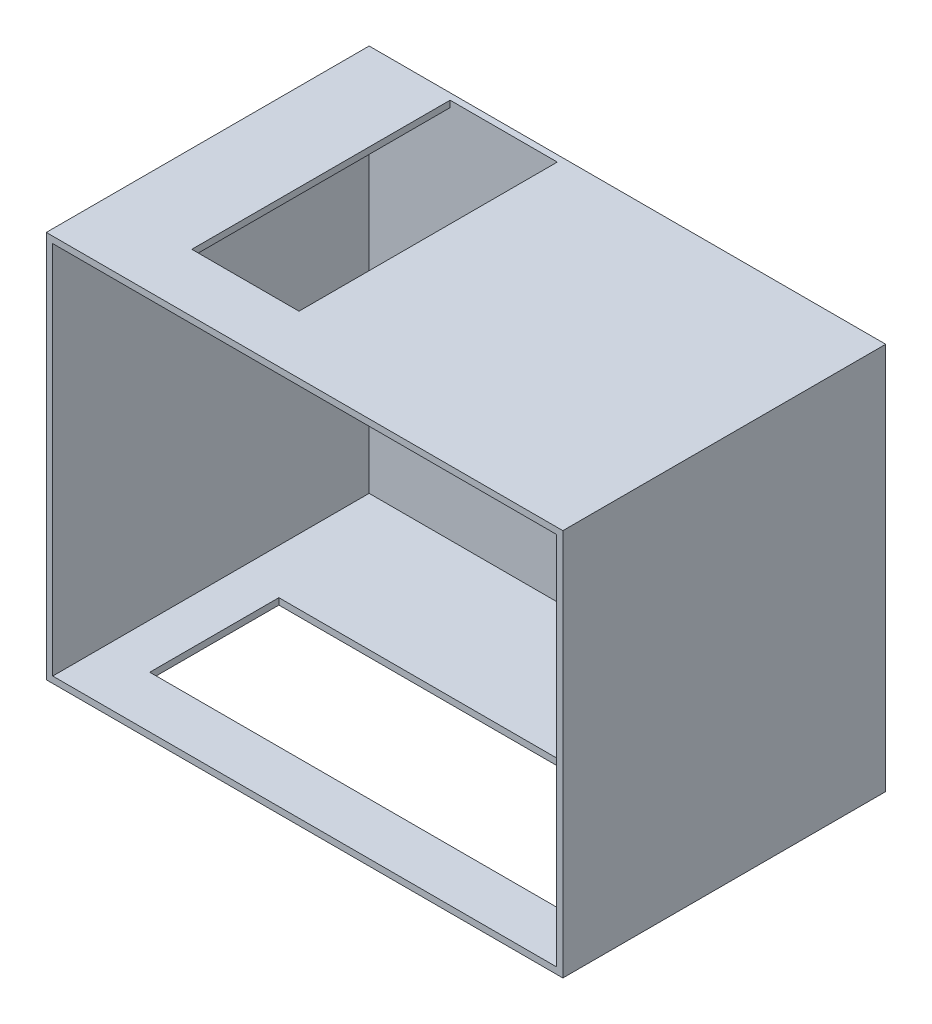
ISO-10303-21;
HEADER;
FILE_DESCRIPTION(('STEP AP214'),'2;1');
FILE_NAME('part.step','',(''),(''),'','','');
FILE_SCHEMA(('AUTOMOTIVE_DESIGN { 1 0 10303 214 1 1 1 1 }'));
ENDSEC;
DATA;
#1=APPLICATION_CONTEXT('core data for automotive mechanical design processes');
#2=APPLICATION_PROTOCOL_DEFINITION('international standard','automotive_design',2000,#1);
#3=PRODUCT_CONTEXT('',#1,'mechanical');
#4=PRODUCT('Part','Part','',(#3));
#5=PRODUCT_RELATED_PRODUCT_CATEGORY('part','',(#4));
#6=PRODUCT_DEFINITION_FORMATION('','',#4);
#7=PRODUCT_DEFINITION_CONTEXT('part definition',#1,'design');
#8=PRODUCT_DEFINITION('design','',#6,#7);
#9=PRODUCT_DEFINITION_SHAPE('','',#8);
#10=(LENGTH_UNIT() NAMED_UNIT(*) SI_UNIT(.MILLI.,.METRE.));
#11=(NAMED_UNIT(*) PLANE_ANGLE_UNIT() SI_UNIT($,.RADIAN.));
#12=(NAMED_UNIT(*) SI_UNIT($,.STERADIAN.) SOLID_ANGLE_UNIT());
#13=UNCERTAINTY_MEASURE_WITH_UNIT(LENGTH_MEASURE(1.E-05),#10,'distance_accuracy_value','');
#14=(GEOMETRIC_REPRESENTATION_CONTEXT(3) GLOBAL_UNCERTAINTY_ASSIGNED_CONTEXT((#13)) GLOBAL_UNIT_ASSIGNED_CONTEXT((#10,
#11,#12)) REPRESENTATION_CONTEXT('',''));
#15=CARTESIAN_POINT('',(0.,0.,0.));
#16=DIRECTION('',(0.,0.,1.));
#17=DIRECTION('',(1.,0.,0.));
#18=AXIS2_PLACEMENT_3D('',#15,#16,#17);
#19=CARTESIAN_POINT('',(-51.8945911096033,2956.56230521937,2500.));
#20=DIRECTION('',(1.,0.,0.));
#21=DIRECTION('',(0.,1.,0.));
#22=AXIS2_PLACEMENT_3D('',#19,#20,#21);
#23=PLANE('',#22);
#24=DIRECTION('',(0.,-1.,0.));
#25=VECTOR('',#24,1.);
#26=CARTESIAN_POINT('',(-51.8945911096033,2956.56230521937,0.));
#27=LINE('',#26,#25);
#28=CARTESIAN_POINT('',(-51.8945911096033,2956.56230521937,0.));
#29=VERTEX_POINT('',#28);
#30=CARTESIAN_POINT('',(-51.894591109603,-43.4376947806306,0.));
#31=VERTEX_POINT('',#30);
#32=EDGE_CURVE('E216',#29,#31,#27,.T.);
#33=ORIENTED_EDGE('',*,*,#32,.T.);
#34=DIRECTION('',(0.,0.,-1.));
#35=VECTOR('',#34,1.);
#36=CARTESIAN_POINT('',(-51.894591109603,-43.4376947806306,2500.));
#37=LINE('',#36,#35);
#38=CARTESIAN_POINT('',(-51.894591109603,-43.4376947806306,2500.));
#39=VERTEX_POINT('',#38);
#40=EDGE_CURVE('E11',#39,#31,#37,.T.);
#41=ORIENTED_EDGE('',*,*,#40,.F.);
#42=DIRECTION('',(0.,-1.,0.));
#43=VECTOR('',#42,1.);
#44=CARTESIAN_POINT('',(-51.8945911096033,2956.56230521937,2500.));
#45=LINE('',#44,#43);
#46=CARTESIAN_POINT('',(-51.8945911096033,2956.56230521937,2500.));
#47=VERTEX_POINT('',#46);
#48=EDGE_CURVE('E241',#47,#39,#45,.T.);
#49=ORIENTED_EDGE('',*,*,#48,.F.);
#50=DIRECTION('',(0.,0.,-1.));
#51=VECTOR('',#50,1.);
#52=CARTESIAN_POINT('',(-51.8945911096033,2956.56230521937,2500.));
#53=LINE('',#52,#51);
#54=EDGE_CURVE('E251',#47,#29,#53,.T.);
#55=ORIENTED_EDGE('',*,*,#54,.T.);
#56=EDGE_LOOP('',(#33,#41,#49,#55));
#57=FACE_BOUND('',#56,.T.);
#58=ADVANCED_FACE('F31',(#57),#23,.F.);
#59=CARTESIAN_POINT('',(-51.894591109603,-43.4376947806306,2500.));
#60=DIRECTION('',(0.,1.,0.));
#61=DIRECTION('',(0.,0.,1.));
#62=AXIS2_PLACEMENT_3D('',#59,#60,#61);
#63=PLANE('',#62);
#64=DIRECTION('',(1.,0.,0.));
#65=VECTOR('',#64,1.);
#66=CARTESIAN_POINT('',(348.105408890397,-43.4376947806306,1098.95032881053));
#67=LINE('',#66,#65);
#68=CARTESIAN_POINT('',(348.105408890397,-43.4376947806306,1098.95032881053));
#69=VERTEX_POINT('',#68);
#70=CARTESIAN_POINT('',(3548.1054088904,-43.4376947806306,1098.95032881053));
#71=VERTEX_POINT('',#70);
#72=EDGE_CURVE('E191',#69,#71,#67,.T.);
#73=ORIENTED_EDGE('',*,*,#72,.F.);
#74=DIRECTION('',(0.,0.,-1.));
#75=VECTOR('',#74,1.);
#76=CARTESIAN_POINT('',(348.105408890397,-43.4376947806306,2098.95032881053));
#77=LINE('',#76,#75);
#78=CARTESIAN_POINT('',(348.105408890397,-43.4376947806306,2098.95032881053));
#79=VERTEX_POINT('',#78);
#80=EDGE_CURVE('E194',#79,#69,#77,.T.);
#81=ORIENTED_EDGE('',*,*,#80,.F.);
#82=DIRECTION('',(-1.,0.,0.));
#83=VECTOR('',#82,1.);
#84=CARTESIAN_POINT('',(348.105408890397,-43.4376947806306,2098.95032881053));
#85=LINE('',#84,#83);
#86=CARTESIAN_POINT('',(3548.1054088904,-43.4376947806306,2098.95032881053));
#87=VERTEX_POINT('',#86);
#88=EDGE_CURVE('E184',#87,#79,#85,.T.);
#89=ORIENTED_EDGE('',*,*,#88,.F.);
#90=DIRECTION('',(0.,0.,1.));
#91=VECTOR('',#90,1.);
#92=CARTESIAN_POINT('',(3548.1054088904,-43.4376947806306,2098.95032881053));
#93=LINE('',#92,#91);
#94=EDGE_CURVE('E188',#71,#87,#93,.T.);
#95=ORIENTED_EDGE('',*,*,#94,.F.);
#96=EDGE_LOOP('',(#73,#81,#89,#95));
#97=FACE_BOUND('',#96,.T.);
#98=DIRECTION('',(1.,0.,0.));
#99=VECTOR('',#98,1.);
#100=CARTESIAN_POINT('',(-51.894591109603,-43.4376947806306,0.));
#101=LINE('',#100,#99);
#102=CARTESIAN_POINT('',(3948.1054088904,-43.4376947806306,0.));
#103=VERTEX_POINT('',#102);
#104=EDGE_CURVE('E254',#31,#103,#101,.T.);
#105=ORIENTED_EDGE('',*,*,#104,.T.);
#106=DIRECTION('',(0.,0.,-1.));
#107=VECTOR('',#106,1.);
#108=CARTESIAN_POINT('',(3948.1054088904,-43.4376947806306,2500.));
#109=LINE('',#108,#107);
#110=CARTESIAN_POINT('',(3948.1054088904,-43.4376947806306,2500.));
#111=VERTEX_POINT('',#110);
#112=EDGE_CURVE('E38',#111,#103,#109,.T.);
#113=ORIENTED_EDGE('',*,*,#112,.F.);
#114=DIRECTION('',(1.,0.,0.));
#115=VECTOR('',#114,1.);
#116=CARTESIAN_POINT('',(-51.894591109603,-43.4376947806306,2500.));
#117=LINE('',#116,#115);
#118=EDGE_CURVE('E244',#39,#111,#117,.T.);
#119=ORIENTED_EDGE('',*,*,#118,.F.);
#120=ORIENTED_EDGE('',*,*,#40,.T.);
#121=EDGE_LOOP('',(#105,#113,#119,#120));
#122=FACE_BOUND('',#121,.T.);
#123=ADVANCED_FACE('F282',(#97,#122),#63,.F.);
#124=CARTESIAN_POINT('',(3948.1054088904,2956.56230521937,2500.));
#125=DIRECTION('',(-1.,0.,0.));
#126=DIRECTION('',(0.,-1.,0.));
#127=AXIS2_PLACEMENT_3D('',#124,#125,#126);
#128=PLANE('',#127);
#129=DIRECTION('',(0.,1.,0.));
#130=VECTOR('',#129,1.);
#131=CARTESIAN_POINT('',(3948.1054088904,2956.56230521937,0.));
#132=LINE('',#131,#130);
#133=CARTESIAN_POINT('',(3948.1054088904,2956.56230521937,0.));
#134=VERTEX_POINT('',#133);
#135=EDGE_CURVE('E256',#103,#134,#132,.T.);
#136=ORIENTED_EDGE('',*,*,#135,.T.);
#137=DIRECTION('',(0.,0.,-1.));
#138=VECTOR('',#137,1.);
#139=CARTESIAN_POINT('',(3948.1054088904,2956.56230521937,2500.));
#140=LINE('',#139,#138);
#141=CARTESIAN_POINT('',(3948.1054088904,2956.56230521937,2500.));
#142=VERTEX_POINT('',#141);
#143=EDGE_CURVE('E261',#142,#134,#140,.T.);
#144=ORIENTED_EDGE('',*,*,#143,.F.);
#145=DIRECTION('',(0.,1.,0.));
#146=VECTOR('',#145,1.);
#147=CARTESIAN_POINT('',(3948.1054088904,2956.56230521937,2500.));
#148=LINE('',#147,#146);
#149=EDGE_CURVE('E247',#111,#142,#148,.T.);
#150=ORIENTED_EDGE('',*,*,#149,.F.);
#151=ORIENTED_EDGE('',*,*,#112,.T.);
#152=EDGE_LOOP('',(#136,#144,#150,#151));
#153=FACE_BOUND('',#152,.T.);
#154=ADVANCED_FACE('F268',(#153),#128,.F.);
#155=CARTESIAN_POINT('',(-51.8945911096033,2956.56230521937,2500.));
#156=DIRECTION('',(0.,-1.,0.));
#157=DIRECTION('',(0.,0.,-1.));
#158=AXIS2_PLACEMENT_3D('',#155,#156,#157);
#159=PLANE('',#158);
#160=DIRECTION('',(1.,0.,0.));
#161=VECTOR('',#160,1.);
#162=CARTESIAN_POINT('',(624.93063748417,2956.56230521937,2050.));
#163=LINE('',#162,#161);
#164=CARTESIAN_POINT('',(624.93063748417,2956.56230521937,2050.));
#165=VERTEX_POINT('',#164);
#166=CARTESIAN_POINT('',(1454.93063748417,2956.56230521937,2050.));
#167=VERTEX_POINT('',#166);
#168=EDGE_CURVE('E164',#165,#167,#163,.T.);
#169=ORIENTED_EDGE('',*,*,#168,.F.);
#170=DIRECTION('',(0.,0.,1.));
#171=VECTOR('',#170,1.);
#172=CARTESIAN_POINT('',(624.930637484169,2956.56230521937,50.));
#173=LINE('',#172,#171);
#174=CARTESIAN_POINT('',(624.930637484169,2956.56230521937,50.));
#175=VERTEX_POINT('',#174);
#176=EDGE_CURVE('E145',#175,#165,#173,.T.);
#177=ORIENTED_EDGE('',*,*,#176,.F.);
#178=DIRECTION('',(-1.,0.,0.));
#179=VECTOR('',#178,1.);
#180=CARTESIAN_POINT('',(624.930637484169,2956.56230521937,50.));
#181=LINE('',#180,#179);
#182=CARTESIAN_POINT('',(1454.93063748417,2956.56230521937,49.9999999999998));
#183=VERTEX_POINT('',#182);
#184=EDGE_CURVE('E153',#183,#175,#181,.T.);
#185=ORIENTED_EDGE('',*,*,#184,.F.);
#186=DIRECTION('',(0.,0.,-1.));
#187=VECTOR('',#186,1.);
#188=CARTESIAN_POINT('',(1454.93063748417,2956.56230521937,50.));
#189=LINE('',#188,#187);
#190=EDGE_CURVE('E45',#167,#183,#189,.T.);
#191=ORIENTED_EDGE('',*,*,#190,.F.);
#192=EDGE_LOOP('',(#169,#177,#185,#191));
#193=FACE_BOUND('',#192,.T.);
#194=DIRECTION('',(-1.,0.,0.));
#195=VECTOR('',#194,1.);
#196=CARTESIAN_POINT('',(-51.8945911096033,2956.56230521937,0.));
#197=LINE('',#196,#195);
#198=EDGE_CURVE('E245',#134,#29,#197,.T.);
#199=ORIENTED_EDGE('',*,*,#198,.T.);
#200=ORIENTED_EDGE('',*,*,#54,.F.);
#201=DIRECTION('',(-1.,0.,0.));
#202=VECTOR('',#201,1.);
#203=CARTESIAN_POINT('',(-51.8945911096033,2956.56230521937,2500.));
#204=LINE('',#203,#202);
#205=EDGE_CURVE('E249',#142,#47,#204,.T.);
#206=ORIENTED_EDGE('',*,*,#205,.F.);
#207=ORIENTED_EDGE('',*,*,#143,.T.);
#208=EDGE_LOOP('',(#199,#200,#206,#207));
#209=FACE_BOUND('',#208,.T.);
#210=ADVANCED_FACE('F161',(#193,#209),#159,.F.);
#211=CARTESIAN_POINT('',(-51.894591109603,-43.4376947806306,2500.));
#212=DIRECTION('',(0.,0.,1.));
#213=DIRECTION('',(1.,0.,0.));
#214=AXIS2_PLACEMENT_3D('',#211,#212,#213);
#215=PLANE('',#214);
#216=DIRECTION('',(0.,-1.,0.));
#217=VECTOR('',#216,1.);
#218=CARTESIAN_POINT('',(-1.89459110960333,2956.56230521937,2500.));
#219=LINE('',#218,#217);
#220=CARTESIAN_POINT('',(-1.89459110960332,2906.56230521937,2500.));
#221=VERTEX_POINT('',#220);
#222=CARTESIAN_POINT('',(-1.89459110960296,6.56230521936936,2500.));
#223=VERTEX_POINT('',#222);
#224=EDGE_CURVE('E233',#221,#223,#219,.T.);
#225=ORIENTED_EDGE('',*,*,#224,.F.);
#226=DIRECTION('',(-1.,0.,0.));
#227=VECTOR('',#226,1.);
#228=CARTESIAN_POINT('',(-51.8945911096033,2906.56230521937,2500.));
#229=LINE('',#228,#227);
#230=CARTESIAN_POINT('',(3898.1054088904,2906.56230521937,2500.));
#231=VERTEX_POINT('',#230);
#232=EDGE_CURVE('E222',#231,#221,#229,.T.);
#233=ORIENTED_EDGE('',*,*,#232,.F.);
#234=DIRECTION('',(0.,1.,0.));
#235=VECTOR('',#234,1.);
#236=CARTESIAN_POINT('',(3898.1054088904,2956.56230521937,2500.));
#237=LINE('',#236,#235);
#238=CARTESIAN_POINT('',(3898.1054088904,6.56230521936936,2500.));
#239=VERTEX_POINT('',#238);
#240=EDGE_CURVE('E237',#239,#231,#237,.T.);
#241=ORIENTED_EDGE('',*,*,#240,.F.);
#242=DIRECTION('',(1.,0.,0.));
#243=VECTOR('',#242,1.);
#244=CARTESIAN_POINT('',(-51.894591109603,6.56230521936936,2500.));
#245=LINE('',#244,#243);
#246=EDGE_CURVE('E235',#223,#239,#245,.T.);
#247=ORIENTED_EDGE('',*,*,#246,.F.);
#248=EDGE_LOOP('',(#225,#233,#241,#247));
#249=FACE_BOUND('',#248,.T.);
#250=ORIENTED_EDGE('',*,*,#48,.T.);
#251=ORIENTED_EDGE('',*,*,#118,.T.);
#252=ORIENTED_EDGE('',*,*,#149,.T.);
#253=ORIENTED_EDGE('',*,*,#205,.T.);
#254=EDGE_LOOP('',(#250,#251,#252,#253));
#255=FACE_BOUND('',#254,.T.);
#256=ADVANCED_FACE('F281',(#249,#255),#215,.T.);
#257=CARTESIAN_POINT('',(-51.894591109603,-43.4376947806306,0.));
#258=DIRECTION('',(0.,0.,1.));
#259=DIRECTION('',(1.,0.,0.));
#260=AXIS2_PLACEMENT_3D('',#257,#258,#259);
#261=PLANE('',#260);
#262=ORIENTED_EDGE('',*,*,#32,.F.);
#263=ORIENTED_EDGE('',*,*,#198,.F.);
#264=ORIENTED_EDGE('',*,*,#135,.F.);
#265=ORIENTED_EDGE('',*,*,#104,.F.);
#266=EDGE_LOOP('',(#262,#263,#264,#265));
#267=FACE_BOUND('',#266,.T.);
#268=ADVANCED_FACE('F274',(#267),#261,.F.);
#269=CARTESIAN_POINT('',(-1.89459110960333,2956.56230521937,2500.));
#270=DIRECTION('',(1.,0.,0.));
#271=DIRECTION('',(0.,1.,0.));
#272=AXIS2_PLACEMENT_3D('',#269,#270,#271);
#273=PLANE('',#272);
#274=DIRECTION('',(0.,-1.,0.));
#275=VECTOR('',#274,1.);
#276=CARTESIAN_POINT('',(-1.89459110960333,2956.56230521937,49.9999999999998));
#277=LINE('',#276,#275);
#278=CARTESIAN_POINT('',(-1.89459110960332,2906.56230521937,50.));
#279=VERTEX_POINT('',#278);
#280=CARTESIAN_POINT('',(-1.89459110960296,6.56230521936936,50.));
#281=VERTEX_POINT('',#280);
#282=EDGE_CURVE('E187',#279,#281,#277,.T.);
#283=ORIENTED_EDGE('',*,*,#282,.F.);
#284=DIRECTION('',(0.,0.,-1.));
#285=VECTOR('',#284,1.);
#286=CARTESIAN_POINT('',(-1.89459110960332,2906.56230521937,2500.));
#287=LINE('',#286,#285);
#288=EDGE_CURVE('E218',#221,#279,#287,.T.);
#289=ORIENTED_EDGE('',*,*,#288,.F.);
#290=ORIENTED_EDGE('',*,*,#224,.T.);
#291=DIRECTION('',(0.,0.,-1.));
#292=VECTOR('',#291,1.);
#293=CARTESIAN_POINT('',(-1.89459110960296,6.56230521936936,2500.));
#294=LINE('',#293,#292);
#295=EDGE_CURVE('E213',#223,#281,#294,.T.);
#296=ORIENTED_EDGE('',*,*,#295,.T.);
#297=EDGE_LOOP('',(#283,#289,#290,#296));
#298=FACE_BOUND('',#297,.T.);
#299=ADVANCED_FACE('F296',(#298),#273,.T.);
#300=CARTESIAN_POINT('',(-51.894591109603,6.56230521936936,2500.));
#301=DIRECTION('',(0.,1.,0.));
#302=DIRECTION('',(0.,0.,1.));
#303=AXIS2_PLACEMENT_3D('',#300,#301,#302);
#304=PLANE('',#303);
#305=DIRECTION('',(0.,0.,-1.));
#306=VECTOR('',#305,1.);
#307=CARTESIAN_POINT('',(348.105408890397,6.56230521936951,2098.95032881053));
#308=LINE('',#307,#306);
#309=CARTESIAN_POINT('',(348.105408890397,6.56230521936951,2098.95032881053));
#310=VERTEX_POINT('',#309);
#311=CARTESIAN_POINT('',(348.105408890397,6.56230521936951,1098.95032881053));
#312=VERTEX_POINT('',#311);
#313=EDGE_CURVE('E158',#310,#312,#308,.T.);
#314=ORIENTED_EDGE('',*,*,#313,.T.);
#315=DIRECTION('',(1.,0.,0.));
#316=VECTOR('',#315,1.);
#317=CARTESIAN_POINT('',(348.105408890397,6.56230521936951,1098.95032881053));
#318=LINE('',#317,#316);
#319=CARTESIAN_POINT('',(3548.1054088904,6.56230521936936,1098.95032881053));
#320=VERTEX_POINT('',#319);
#321=EDGE_CURVE('E179',#312,#320,#318,.T.);
#322=ORIENTED_EDGE('',*,*,#321,.T.);
#323=DIRECTION('',(0.,0.,1.));
#324=VECTOR('',#323,1.);
#325=CARTESIAN_POINT('',(3548.1054088904,6.56230521936951,2098.95032881053));
#326=LINE('',#325,#324);
#327=CARTESIAN_POINT('',(3548.1054088904,6.56230521936951,2098.95032881053));
#328=VERTEX_POINT('',#327);
#329=EDGE_CURVE('E203',#320,#328,#326,.T.);
#330=ORIENTED_EDGE('',*,*,#329,.T.);
#331=DIRECTION('',(-1.,0.,0.));
#332=VECTOR('',#331,1.);
#333=CARTESIAN_POINT('',(348.105408890397,6.56230521936951,2098.95032881053));
#334=LINE('',#333,#332);
#335=EDGE_CURVE('E199',#328,#310,#334,.T.);
#336=ORIENTED_EDGE('',*,*,#335,.T.);
#337=EDGE_LOOP('',(#314,#322,#330,#336));
#338=FACE_BOUND('',#337,.T.);
#339=DIRECTION('',(1.,0.,0.));
#340=VECTOR('',#339,1.);
#341=CARTESIAN_POINT('',(-51.894591109603,6.56230521936936,49.9999999999998));
#342=LINE('',#341,#340);
#343=CARTESIAN_POINT('',(3898.1054088904,6.56230521936936,50.));
#344=VERTEX_POINT('',#343);
#345=EDGE_CURVE('E212',#281,#344,#342,.T.);
#346=ORIENTED_EDGE('',*,*,#345,.F.);
#347=ORIENTED_EDGE('',*,*,#295,.F.);
#348=ORIENTED_EDGE('',*,*,#246,.T.);
#349=DIRECTION('',(0.,0.,-1.));
#350=VECTOR('',#349,1.);
#351=CARTESIAN_POINT('',(3898.1054088904,6.56230521936951,2500.));
#352=LINE('',#351,#350);
#353=EDGE_CURVE('E217',#239,#344,#352,.T.);
#354=ORIENTED_EDGE('',*,*,#353,.T.);
#355=EDGE_LOOP('',(#346,#347,#348,#354));
#356=FACE_BOUND('',#355,.T.);
#357=ADVANCED_FACE('F310',(#338,#356),#304,.T.);
#358=CARTESIAN_POINT('',(3898.1054088904,2956.56230521937,2500.));
#359=DIRECTION('',(-1.,0.,0.));
#360=DIRECTION('',(0.,-1.,0.));
#361=AXIS2_PLACEMENT_3D('',#358,#359,#360);
#362=PLANE('',#361);
#363=DIRECTION('',(0.,1.,0.));
#364=VECTOR('',#363,1.);
#365=CARTESIAN_POINT('',(3898.1054088904,2956.56230521937,49.9999999999998));
#366=LINE('',#365,#364);
#367=CARTESIAN_POINT('',(3898.1054088904,2906.56230521937,50.));
#368=VERTEX_POINT('',#367);
#369=EDGE_CURVE('E224',#344,#368,#366,.T.);
#370=ORIENTED_EDGE('',*,*,#369,.F.);
#371=ORIENTED_EDGE('',*,*,#353,.F.);
#372=ORIENTED_EDGE('',*,*,#240,.T.);
#373=DIRECTION('',(0.,0.,-1.));
#374=VECTOR('',#373,1.);
#375=CARTESIAN_POINT('',(3898.1054088904,2906.56230521937,2500.));
#376=LINE('',#375,#374);
#377=EDGE_CURVE('E221',#231,#368,#376,.T.);
#378=ORIENTED_EDGE('',*,*,#377,.T.);
#379=EDGE_LOOP('',(#370,#371,#372,#378));
#380=FACE_BOUND('',#379,.T.);
#381=ADVANCED_FACE('F306',(#380),#362,.T.);
#382=CARTESIAN_POINT('',(-51.8945911096033,2906.56230521937,2500.));
#383=DIRECTION('',(0.,-1.,0.));
#384=DIRECTION('',(0.,0.,-1.));
#385=AXIS2_PLACEMENT_3D('',#382,#383,#384);
#386=PLANE('',#385);
#387=DIRECTION('',(0.,0.,-1.));
#388=VECTOR('',#387,1.);
#389=CARTESIAN_POINT('',(624.930637484169,2906.56230521937,50.));
#390=LINE('',#389,#388);
#391=CARTESIAN_POINT('',(624.93063748417,2906.56230521937,2050.));
#392=VERTEX_POINT('',#391);
#393=CARTESIAN_POINT('',(624.930637484169,2906.56230521937,49.9999999999998));
#394=VERTEX_POINT('',#393);
#395=EDGE_CURVE('E53',#392,#394,#390,.T.);
#396=ORIENTED_EDGE('',*,*,#395,.F.);
#397=DIRECTION('',(-1.,0.,0.));
#398=VECTOR('',#397,1.);
#399=CARTESIAN_POINT('',(624.93063748417,2906.56230521937,2050.));
#400=LINE('',#399,#398);
#401=CARTESIAN_POINT('',(1454.93063748417,2906.56230521937,2050.));
#402=VERTEX_POINT('',#401);
#403=EDGE_CURVE('E150',#402,#392,#400,.T.);
#404=ORIENTED_EDGE('',*,*,#403,.F.);
#405=DIRECTION('',(0.,0.,1.));
#406=VECTOR('',#405,1.);
#407=CARTESIAN_POINT('',(1454.93063748417,2906.56230521937,50.));
#408=LINE('',#407,#406);
#409=CARTESIAN_POINT('',(1454.93063748417,2906.56230521937,50.));
#410=VERTEX_POINT('',#409);
#411=EDGE_CURVE('E166',#410,#402,#408,.T.);
#412=ORIENTED_EDGE('',*,*,#411,.F.);
#413=DIRECTION('',(-1.,0.,0.));
#414=VECTOR('',#413,1.);
#415=CARTESIAN_POINT('',(-51.8945911096033,2906.56230521937,49.9999999999998));
#416=LINE('',#415,#414);
#417=EDGE_CURVE('E231',#368,#410,#416,.T.);
#418=ORIENTED_EDGE('',*,*,#417,.F.);
#419=ORIENTED_EDGE('',*,*,#377,.F.);
#420=ORIENTED_EDGE('',*,*,#232,.T.);
#421=ORIENTED_EDGE('',*,*,#288,.T.);
#422=EDGE_CURVE('E228',#394,#279,#416,.T.);
#423=ORIENTED_EDGE('',*,*,#422,.F.);
#424=EDGE_LOOP('',(#396,#404,#412,#418,#419,#420,#421,#423));
#425=FACE_BOUND('',#424,.T.);
#426=ADVANCED_FACE('F303',(#425),#386,.T.);
#427=CARTESIAN_POINT('',(-51.894591109603,-43.4376947806306,50.));
#428=DIRECTION('',(0.,0.,1.));
#429=DIRECTION('',(1.,0.,0.));
#430=AXIS2_PLACEMENT_3D('',#427,#428,#429);
#431=PLANE('',#430);
#432=ORIENTED_EDGE('',*,*,#282,.T.);
#433=ORIENTED_EDGE('',*,*,#345,.T.);
#434=ORIENTED_EDGE('',*,*,#369,.T.);
#435=ORIENTED_EDGE('',*,*,#417,.T.);
#436=DIRECTION('',(0.,-1.,0.));
#437=VECTOR('',#436,1.);
#438=CARTESIAN_POINT('',(1454.93063748417,2956.56330521937,50.));
#439=LINE('',#438,#437);
#440=EDGE_CURVE('E149',#183,#410,#439,.T.);
#441=ORIENTED_EDGE('',*,*,#440,.F.);
#442=ORIENTED_EDGE('',*,*,#184,.T.);
#443=DIRECTION('',(0.,-1.,0.));
#444=VECTOR('',#443,1.);
#445=CARTESIAN_POINT('',(624.930637484169,2956.56330521937,50.));
#446=LINE('',#445,#444);
#447=EDGE_CURVE('E141',#175,#394,#446,.T.);
#448=ORIENTED_EDGE('',*,*,#447,.T.);
#449=ORIENTED_EDGE('',*,*,#422,.T.);
#450=EDGE_LOOP('',(#432,#433,#434,#435,#441,#442,#448,#449));
#451=FACE_BOUND('',#450,.T.);
#452=ADVANCED_FACE('F155',(#451),#431,.T.);
#453=CARTESIAN_POINT('',(348.105408890397,2956.56330521937,2098.95032881053));
#454=DIRECTION('',(-1.,0.,0.));
#455=DIRECTION('',(0.,0.,1.));
#456=AXIS2_PLACEMENT_3D('',#453,#454,#455);
#457=PLANE('',#456);
#458=DIRECTION('',(0.,-1.,0.));
#459=VECTOR('',#458,1.);
#460=CARTESIAN_POINT('',(348.105408890397,2956.56330521937,2098.95032881053));
#461=LINE('',#460,#459);
#462=EDGE_CURVE('E202',#310,#79,#461,.T.);
#463=ORIENTED_EDGE('',*,*,#462,.T.);
#464=ORIENTED_EDGE('',*,*,#80,.T.);
#465=DIRECTION('',(0.,-1.,0.));
#466=VECTOR('',#465,1.);
#467=CARTESIAN_POINT('',(348.105408890397,2956.56330521937,1098.95032881053));
#468=LINE('',#467,#466);
#469=EDGE_CURVE('E198',#312,#69,#468,.T.);
#470=ORIENTED_EDGE('',*,*,#469,.F.);
#471=ORIENTED_EDGE('',*,*,#313,.F.);
#472=EDGE_LOOP('',(#463,#464,#470,#471));
#473=FACE_BOUND('',#472,.T.);
#474=ADVANCED_FACE('F302',(#473),#457,.F.);
#475=CARTESIAN_POINT('',(348.105408890397,2956.56330521937,2098.95032881053));
#476=DIRECTION('',(0.,0.,1.));
#477=DIRECTION('',(1.,0.,0.));
#478=AXIS2_PLACEMENT_3D('',#475,#476,#477);
#479=PLANE('',#478);
#480=DIRECTION('',(0.,-1.,0.));
#481=VECTOR('',#480,1.);
#482=CARTESIAN_POINT('',(3548.1054088904,2956.56330521937,2098.95032881053));
#483=LINE('',#482,#481);
#484=EDGE_CURVE('E183',#328,#87,#483,.T.);
#485=ORIENTED_EDGE('',*,*,#484,.T.);
#486=ORIENTED_EDGE('',*,*,#88,.T.);
#487=ORIENTED_EDGE('',*,*,#462,.F.);
#488=ORIENTED_EDGE('',*,*,#335,.F.);
#489=EDGE_LOOP('',(#485,#486,#487,#488));
#490=FACE_BOUND('',#489,.T.);
#491=ADVANCED_FACE('F320',(#490),#479,.F.);
#492=CARTESIAN_POINT('',(3548.1054088904,2956.56330521937,2098.95032881053));
#493=DIRECTION('',(1.,0.,0.));
#494=DIRECTION('',(0.,0.,-1.));
#495=AXIS2_PLACEMENT_3D('',#492,#493,#494);
#496=PLANE('',#495);
#497=DIRECTION('',(0.,-1.,0.));
#498=VECTOR('',#497,1.);
#499=CARTESIAN_POINT('',(3548.1054088904,2956.56330521937,1098.95032881053));
#500=LINE('',#499,#498);
#501=EDGE_CURVE('E182',#320,#71,#500,.T.);
#502=ORIENTED_EDGE('',*,*,#501,.T.);
#503=ORIENTED_EDGE('',*,*,#94,.T.);
#504=ORIENTED_EDGE('',*,*,#484,.F.);
#505=ORIENTED_EDGE('',*,*,#329,.F.);
#506=EDGE_LOOP('',(#502,#503,#504,#505));
#507=FACE_BOUND('',#506,.T.);
#508=ADVANCED_FACE('F324',(#507),#496,.F.);
#509=CARTESIAN_POINT('',(348.105408890397,2956.56330521937,1098.95032881053));
#510=DIRECTION('',(0.,0.,-1.));
#511=DIRECTION('',(-1.,0.,0.));
#512=AXIS2_PLACEMENT_3D('',#509,#510,#511);
#513=PLANE('',#512);
#514=ORIENTED_EDGE('',*,*,#469,.T.);
#515=ORIENTED_EDGE('',*,*,#72,.T.);
#516=ORIENTED_EDGE('',*,*,#501,.F.);
#517=ORIENTED_EDGE('',*,*,#321,.F.);
#518=EDGE_LOOP('',(#514,#515,#516,#517));
#519=FACE_BOUND('',#518,.T.);
#520=ADVANCED_FACE('F328',(#519),#513,.F.);
#521=CARTESIAN_POINT('',(624.930637484169,2956.56330521937,50.));
#522=DIRECTION('',(-1.,0.,0.));
#523=DIRECTION('',(0.,0.,1.));
#524=AXIS2_PLACEMENT_3D('',#521,#522,#523);
#525=PLANE('',#524);
#526=ORIENTED_EDGE('',*,*,#176,.T.);
#527=DIRECTION('',(0.,-1.,0.));
#528=VECTOR('',#527,1.);
#529=CARTESIAN_POINT('',(624.93063748417,2956.56330521937,2050.));
#530=LINE('',#529,#528);
#531=EDGE_CURVE('E159',#165,#392,#530,.T.);
#532=ORIENTED_EDGE('',*,*,#531,.T.);
#533=ORIENTED_EDGE('',*,*,#395,.T.);
#534=ORIENTED_EDGE('',*,*,#447,.F.);
#535=EDGE_LOOP('',(#526,#532,#533,#534));
#536=FACE_BOUND('',#535,.T.);
#537=ADVANCED_FACE('F143',(#536),#525,.F.);
#538=CARTESIAN_POINT('',(624.93063748417,2956.56330521937,2050.));
#539=DIRECTION('',(0.,0.,1.));
#540=DIRECTION('',(1.,0.,0.));
#541=AXIS2_PLACEMENT_3D('',#538,#539,#540);
#542=PLANE('',#541);
#543=ORIENTED_EDGE('',*,*,#168,.T.);
#544=DIRECTION('',(0.,-1.,0.));
#545=VECTOR('',#544,1.);
#546=CARTESIAN_POINT('',(1454.93063748417,2956.56330521937,2050.));
#547=LINE('',#546,#545);
#548=EDGE_CURVE('E176',#167,#402,#547,.T.);
#549=ORIENTED_EDGE('',*,*,#548,.T.);
#550=ORIENTED_EDGE('',*,*,#403,.T.);
#551=ORIENTED_EDGE('',*,*,#531,.F.);
#552=EDGE_LOOP('',(#543,#549,#550,#551));
#553=FACE_BOUND('',#552,.T.);
#554=ADVANCED_FACE('F335',(#553),#542,.F.);
#555=CARTESIAN_POINT('',(1454.93063748417,2956.56330521937,50.));
#556=DIRECTION('',(1.,0.,0.));
#557=DIRECTION('',(0.,0.,-1.));
#558=AXIS2_PLACEMENT_3D('',#555,#556,#557);
#559=PLANE('',#558);
#560=ORIENTED_EDGE('',*,*,#190,.T.);
#561=ORIENTED_EDGE('',*,*,#440,.T.);
#562=ORIENTED_EDGE('',*,*,#411,.T.);
#563=ORIENTED_EDGE('',*,*,#548,.F.);
#564=EDGE_LOOP('',(#560,#561,#562,#563));
#565=FACE_BOUND('',#564,.T.);
#566=ADVANCED_FACE('F336',(#565),#559,.F.);
#567=CLOSED_SHELL('',(#58,#123,#154,#210,#256,#268,#299,#357,#381,#426,#452,#474,#491,#508,#520,
#537,#554,#566));
#568=MANIFOLD_SOLID_BREP('B2',#567);
#569=ADVANCED_BREP_SHAPE_REPRESENTATION('',(#18,#568),#14);
#570=SHAPE_DEFINITION_REPRESENTATION(#9,#569);
ENDSEC;
END-ISO-10303-21;
